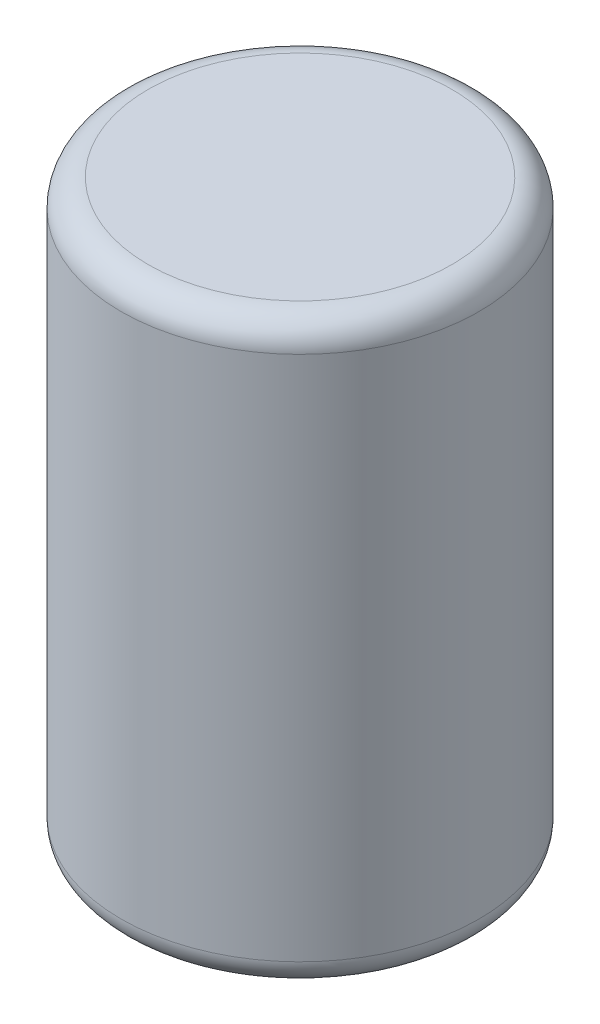
ISO-10303-21;
HEADER;
FILE_DESCRIPTION(('STEP AP214'),'2;1');
FILE_NAME('part.step','',(''),(''),'','','');
FILE_SCHEMA(('AUTOMOTIVE_DESIGN { 1 0 10303 214 1 1 1 1 }'));
ENDSEC;
DATA;
#1=APPLICATION_CONTEXT('core data for automotive mechanical design processes');
#2=APPLICATION_PROTOCOL_DEFINITION('international standard','automotive_design',2000,#1);
#3=PRODUCT_CONTEXT('',#1,'mechanical');
#4=PRODUCT('Part','Part','',(#3));
#5=PRODUCT_RELATED_PRODUCT_CATEGORY('part','',(#4));
#6=PRODUCT_DEFINITION_FORMATION('','',#4);
#7=PRODUCT_DEFINITION_CONTEXT('part definition',#1,'design');
#8=PRODUCT_DEFINITION('design','',#6,#7);
#9=PRODUCT_DEFINITION_SHAPE('','',#8);
#10=(LENGTH_UNIT() NAMED_UNIT(*) SI_UNIT(.MILLI.,.METRE.));
#11=(NAMED_UNIT(*) PLANE_ANGLE_UNIT() SI_UNIT($,.RADIAN.));
#12=(NAMED_UNIT(*) SI_UNIT($,.STERADIAN.) SOLID_ANGLE_UNIT());
#13=UNCERTAINTY_MEASURE_WITH_UNIT(LENGTH_MEASURE(1.E-05),#10,'distance_accuracy_value','');
#14=(GEOMETRIC_REPRESENTATION_CONTEXT(3) GLOBAL_UNCERTAINTY_ASSIGNED_CONTEXT((#13)) GLOBAL_UNIT_ASSIGNED_CONTEXT((#10,
#11,#12)) REPRESENTATION_CONTEXT('',''));
#15=CARTESIAN_POINT('',(0.,0.,0.));
#16=DIRECTION('',(0.,0.,1.));
#17=DIRECTION('',(1.,0.,0.));
#18=AXIS2_PLACEMENT_3D('',#15,#16,#17);
#19=CARTESIAN_POINT('',(0.,21.4,0.));
#20=DIRECTION('',(0.,-1.,0.));
#21=DIRECTION('',(0.,0.,-1.));
#22=AXIS2_PLACEMENT_3D('',#19,#20,#21);
#23=CYLINDRICAL_SURFACE('',#22,6.6);
#24=CARTESIAN_POINT('',(0.,1.,0.));
#25=DIRECTION('',(0.,1.,0.));
#26=DIRECTION('',(0.,0.,1.));
#27=AXIS2_PLACEMENT_3D('',#24,#25,#26);
#28=CIRCLE('',#27,6.6);
#29=CARTESIAN_POINT('',(0.,1.,6.6));
#30=VERTEX_POINT('',#29);
#31=EDGE_CURVE('E61',#30,#30,#28,.T.);
#32=ORIENTED_EDGE('',*,*,#31,.T.);
#33=EDGE_LOOP('',(#32));
#34=FACE_BOUND('',#33,.T.);
#35=CARTESIAN_POINT('',(0.,20.4,0.));
#36=DIRECTION('',(0.,1.,0.));
#37=DIRECTION('',(0.,0.,1.));
#38=AXIS2_PLACEMENT_3D('',#35,#36,#37);
#39=CIRCLE('',#38,6.6);
#40=CARTESIAN_POINT('',(0.,20.4,6.6));
#41=VERTEX_POINT('',#40);
#42=EDGE_CURVE('E65',#41,#41,#39,.F.);
#43=ORIENTED_EDGE('',*,*,#42,.T.);
#44=EDGE_LOOP('',(#43));
#45=FACE_BOUND('',#44,.T.);
#46=ADVANCED_FACE('F37',(#34,#45),#23,.T.);
#47=CARTESIAN_POINT('',(0.,21.4,0.));
#48=DIRECTION('',(0.,1.,0.));
#49=DIRECTION('',(0.,0.,1.));
#50=AXIS2_PLACEMENT_3D('',#47,#48,#49);
#51=PLANE('',#50);
#52=CARTESIAN_POINT('',(0.,21.4,0.));
#53=DIRECTION('',(0.,1.,0.));
#54=DIRECTION('',(0.,0.,1.));
#55=AXIS2_PLACEMENT_3D('',#52,#53,#54);
#56=CIRCLE('',#55,5.6);
#57=CARTESIAN_POINT('',(0.,21.4,5.6));
#58=VERTEX_POINT('',#57);
#59=EDGE_CURVE('E50',#58,#58,#56,.T.);
#60=ORIENTED_EDGE('',*,*,#59,.T.);
#61=EDGE_LOOP('',(#60));
#62=FACE_BOUND('',#61,.T.);
#63=ADVANCED_FACE('F93',(#62),#51,.T.);
#64=CARTESIAN_POINT('',(0.,0.,0.));
#65=DIRECTION('',(0.,1.,0.));
#66=DIRECTION('',(0.,0.,1.));
#67=AXIS2_PLACEMENT_3D('',#64,#65,#66);
#68=PLANE('',#67);
#69=CARTESIAN_POINT('',(2.5,0.,0.));
#70=DIRECTION('',(0.,1.,0.));
#71=DIRECTION('',(0.,0.,1.));
#72=AXIS2_PLACEMENT_3D('',#69,#70,#71);
#73=CIRCLE('',#72,0.3);
#74=CARTESIAN_POINT('',(2.5,0.,0.3));
#75=VERTEX_POINT('',#74);
#76=EDGE_CURVE('E10',#75,#75,#73,.F.);
#77=ORIENTED_EDGE('',*,*,#76,.F.);
#78=EDGE_LOOP('',(#77));
#79=FACE_BOUND('',#78,.T.);
#80=CARTESIAN_POINT('',(-2.5,0.,0.));
#81=DIRECTION('',(0.,1.,0.));
#82=DIRECTION('',(0.,0.,1.));
#83=AXIS2_PLACEMENT_3D('',#80,#81,#82);
#84=CIRCLE('',#83,0.3);
#85=CARTESIAN_POINT('',(-2.5,0.,0.3));
#86=VERTEX_POINT('',#85);
#87=EDGE_CURVE('E45',#86,#86,#84,.F.);
#88=ORIENTED_EDGE('',*,*,#87,.F.);
#89=EDGE_LOOP('',(#88));
#90=FACE_BOUND('',#89,.T.);
#91=CARTESIAN_POINT('',(0.,0.,0.));
#92=DIRECTION('',(0.,1.,0.));
#93=DIRECTION('',(0.,0.,1.));
#94=AXIS2_PLACEMENT_3D('',#91,#92,#93);
#95=CIRCLE('',#94,5.6);
#96=CARTESIAN_POINT('',(0.,0.,5.6));
#97=VERTEX_POINT('',#96);
#98=EDGE_CURVE('E55',#97,#97,#95,.F.);
#99=ORIENTED_EDGE('',*,*,#98,.T.);
#100=EDGE_LOOP('',(#99));
#101=FACE_BOUND('',#100,.T.);
#102=ADVANCED_FACE('F99',(#79,#90,#101),#68,.F.);
#103=CARTESIAN_POINT('',(0.,1.,0.));
#104=DIRECTION('',(0.,1.,0.));
#105=DIRECTION('',(0.,0.,1.));
#106=AXIS2_PLACEMENT_3D('',#103,#104,#105);
#107=TOROIDAL_SURFACE('',#106,5.6,1.);
#108=ORIENTED_EDGE('',*,*,#98,.F.);
#109=EDGE_LOOP('',(#108));
#110=FACE_BOUND('',#109,.T.);
#111=ORIENTED_EDGE('',*,*,#31,.F.);
#112=EDGE_LOOP('',(#111));
#113=FACE_BOUND('',#112,.T.);
#114=ADVANCED_FACE('F104',(#110,#113),#107,.T.);
#115=CARTESIAN_POINT('',(0.,20.4,0.));
#116=DIRECTION('',(0.,1.,0.));
#117=DIRECTION('',(0.,0.,1.));
#118=AXIS2_PLACEMENT_3D('',#115,#116,#117);
#119=TOROIDAL_SURFACE('',#118,5.6,1.);
#120=ORIENTED_EDGE('',*,*,#42,.F.);
#121=EDGE_LOOP('',(#120));
#122=FACE_BOUND('',#121,.T.);
#123=ORIENTED_EDGE('',*,*,#59,.F.);
#124=EDGE_LOOP('',(#123));
#125=FACE_BOUND('',#124,.T.);
#126=ADVANCED_FACE('F39',(#122,#125),#119,.T.);
#127=CARTESIAN_POINT('',(-2.5,-2.,0.));
#128=DIRECTION('',(0.,1.,0.));
#129=DIRECTION('',(0.,0.,1.));
#130=AXIS2_PLACEMENT_3D('',#127,#128,#129);
#131=CYLINDRICAL_SURFACE('',#130,0.3);
#132=CARTESIAN_POINT('',(-2.5,-2.,0.));
#133=DIRECTION('',(0.,-1.,0.));
#134=DIRECTION('',(0.,0.,-1.));
#135=AXIS2_PLACEMENT_3D('',#132,#133,#134);
#136=CIRCLE('',#135,0.3);
#137=CARTESIAN_POINT('',(-2.5,-2.,-0.3));
#138=VERTEX_POINT('',#137);
#139=EDGE_CURVE('E69',#138,#138,#136,.T.);
#140=ORIENTED_EDGE('',*,*,#139,.F.);
#141=EDGE_LOOP('',(#140));
#142=FACE_BOUND('',#141,.T.);
#143=ORIENTED_EDGE('',*,*,#87,.T.);
#144=EDGE_LOOP('',(#143));
#145=FACE_BOUND('',#144,.T.);
#146=ADVANCED_FACE('F89',(#142,#145),#131,.T.);
#147=CARTESIAN_POINT('',(-2.5,-2.,0.));
#148=DIRECTION('',(0.,-1.,0.));
#149=DIRECTION('',(0.,0.,-1.));
#150=AXIS2_PLACEMENT_3D('',#147,#148,#149);
#151=PLANE('',#150);
#152=ORIENTED_EDGE('',*,*,#139,.T.);
#153=EDGE_LOOP('',(#152));
#154=FACE_BOUND('',#153,.T.);
#155=ADVANCED_FACE('F82',(#154),#151,.T.);
#156=CARTESIAN_POINT('',(2.5,-2.,0.));
#157=DIRECTION('',(0.,1.,0.));
#158=DIRECTION('',(0.,0.,1.));
#159=AXIS2_PLACEMENT_3D('',#156,#157,#158);
#160=CYLINDRICAL_SURFACE('',#159,0.3);
#161=CARTESIAN_POINT('',(2.5,-2.,0.));
#162=DIRECTION('',(0.,-1.,0.));
#163=DIRECTION('',(0.,0.,-1.));
#164=AXIS2_PLACEMENT_3D('',#161,#162,#163);
#165=CIRCLE('',#164,0.3);
#166=CARTESIAN_POINT('',(2.5,-2.,-0.3));
#167=VERTEX_POINT('',#166);
#168=EDGE_CURVE('E73',#167,#167,#165,.T.);
#169=ORIENTED_EDGE('',*,*,#168,.F.);
#170=EDGE_LOOP('',(#169));
#171=FACE_BOUND('',#170,.T.);
#172=ORIENTED_EDGE('',*,*,#76,.T.);
#173=EDGE_LOOP('',(#172));
#174=FACE_BOUND('',#173,.T.);
#175=ADVANCED_FACE('F80',(#171,#174),#160,.T.);
#176=CARTESIAN_POINT('',(2.5,-2.,0.));
#177=DIRECTION('',(0.,-1.,0.));
#178=DIRECTION('',(0.,0.,-1.));
#179=AXIS2_PLACEMENT_3D('',#176,#177,#178);
#180=PLANE('',#179);
#181=ORIENTED_EDGE('',*,*,#168,.T.);
#182=EDGE_LOOP('',(#181));
#183=FACE_BOUND('',#182,.T.);
#184=ADVANCED_FACE('F78',(#183),#180,.T.);
#185=CLOSED_SHELL('',(#46,#63,#102,#114,#126,#146,#155,#175,#184));
#186=MANIFOLD_SOLID_BREP('B2',#185);
#187=ADVANCED_BREP_SHAPE_REPRESENTATION('',(#18,#186),#14);
#188=SHAPE_DEFINITION_REPRESENTATION(#9,#187);
ENDSEC;
END-ISO-10303-21;
